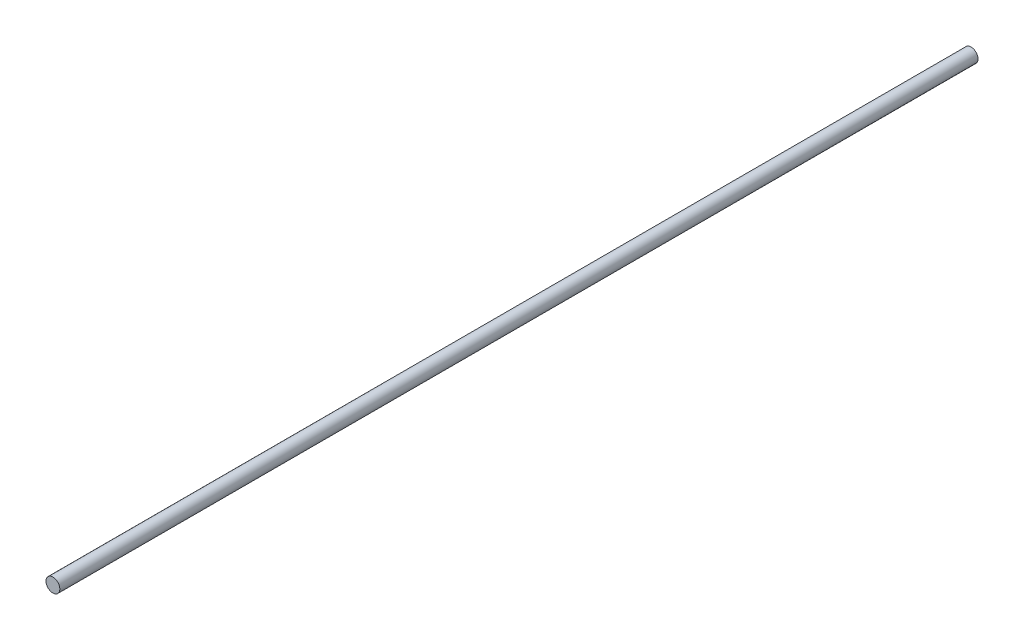
ISO-10303-21;
HEADER;
FILE_DESCRIPTION(('STEP AP214'),'2;1');
FILE_NAME('part.step','',(''),(''),'','','');
FILE_SCHEMA(('AUTOMOTIVE_DESIGN { 1 0 10303 214 1 1 1 1 }'));
ENDSEC;
DATA;
#1=APPLICATION_CONTEXT('core data for automotive mechanical design processes');
#2=APPLICATION_PROTOCOL_DEFINITION('international standard','automotive_design',2000,#1);
#3=PRODUCT_CONTEXT('',#1,'mechanical');
#4=PRODUCT('Part','Part','',(#3));
#5=PRODUCT_RELATED_PRODUCT_CATEGORY('part','',(#4));
#6=PRODUCT_DEFINITION_FORMATION('','',#4);
#7=PRODUCT_DEFINITION_CONTEXT('part definition',#1,'design');
#8=PRODUCT_DEFINITION('design','',#6,#7);
#9=PRODUCT_DEFINITION_SHAPE('','',#8);
#10=(LENGTH_UNIT() NAMED_UNIT(*) SI_UNIT(.MILLI.,.METRE.));
#11=(NAMED_UNIT(*) PLANE_ANGLE_UNIT() SI_UNIT($,.RADIAN.));
#12=(NAMED_UNIT(*) SI_UNIT($,.STERADIAN.) SOLID_ANGLE_UNIT());
#13=UNCERTAINTY_MEASURE_WITH_UNIT(LENGTH_MEASURE(1.E-05),#10,'distance_accuracy_value','');
#14=(GEOMETRIC_REPRESENTATION_CONTEXT(3) GLOBAL_UNCERTAINTY_ASSIGNED_CONTEXT((#13)) GLOBAL_UNIT_ASSIGNED_CONTEXT((#10,
#11,#12)) REPRESENTATION_CONTEXT('',''));
#15=CARTESIAN_POINT('',(0.,0.,0.));
#16=DIRECTION('',(0.,0.,1.));
#17=DIRECTION('',(1.,0.,0.));
#18=AXIS2_PLACEMENT_3D('',#15,#16,#17);
#19=CARTESIAN_POINT('',(0.,0.,263.525));
#20=DIRECTION('',(0.,0.,-1.));
#21=DIRECTION('',(-1.,0.,0.));
#22=AXIS2_PLACEMENT_3D('',#19,#20,#21);
#23=CYLINDRICAL_SURFACE('',#22,3.96875);
#24=CARTESIAN_POINT('',(0.,0.,263.525));
#25=DIRECTION('',(0.,0.,1.));
#26=DIRECTION('',(1.,0.,0.));
#27=AXIS2_PLACEMENT_3D('',#24,#25,#26);
#28=CIRCLE('',#27,3.96875);
#29=CARTESIAN_POINT('',(3.96875,0.,263.525));
#30=VERTEX_POINT('',#29);
#31=EDGE_CURVE('E10',#30,#30,#28,.T.);
#32=ORIENTED_EDGE('',*,*,#31,.F.);
#33=EDGE_LOOP('',(#32));
#34=FACE_BOUND('',#33,.T.);
#35=CARTESIAN_POINT('',(0.,0.,-263.525));
#36=DIRECTION('',(0.,0.,1.));
#37=DIRECTION('',(1.,0.,0.));
#38=AXIS2_PLACEMENT_3D('',#35,#36,#37);
#39=CIRCLE('',#38,3.96875);
#40=CARTESIAN_POINT('',(3.96875,0.,-263.525));
#41=VERTEX_POINT('',#40);
#42=EDGE_CURVE('E34',#41,#41,#39,.T.);
#43=ORIENTED_EDGE('',*,*,#42,.T.);
#44=EDGE_LOOP('',(#43));
#45=FACE_BOUND('',#44,.T.);
#46=ADVANCED_FACE('F31',(#34,#45),#23,.T.);
#47=CARTESIAN_POINT('',(0.,0.,263.525));
#48=DIRECTION('',(0.,0.,1.));
#49=DIRECTION('',(1.,0.,0.));
#50=AXIS2_PLACEMENT_3D('',#47,#48,#49);
#51=PLANE('',#50);
#52=ORIENTED_EDGE('',*,*,#31,.T.);
#53=EDGE_LOOP('',(#52));
#54=FACE_BOUND('',#53,.T.);
#55=ADVANCED_FACE('F46',(#54),#51,.T.);
#56=CARTESIAN_POINT('',(0.,0.,-263.525));
#57=DIRECTION('',(0.,0.,1.));
#58=DIRECTION('',(1.,0.,0.));
#59=AXIS2_PLACEMENT_3D('',#56,#57,#58);
#60=PLANE('',#59);
#61=ORIENTED_EDGE('',*,*,#42,.F.);
#62=EDGE_LOOP('',(#61));
#63=FACE_BOUND('',#62,.T.);
#64=ADVANCED_FACE('F44',(#63),#60,.F.);
#65=CLOSED_SHELL('',(#46,#55,#64));
#66=MANIFOLD_SOLID_BREP('B2',#65);
#67=ADVANCED_BREP_SHAPE_REPRESENTATION('',(#18,#66),#14);
#68=SHAPE_DEFINITION_REPRESENTATION(#9,#67);
ENDSEC;
END-ISO-10303-21;
